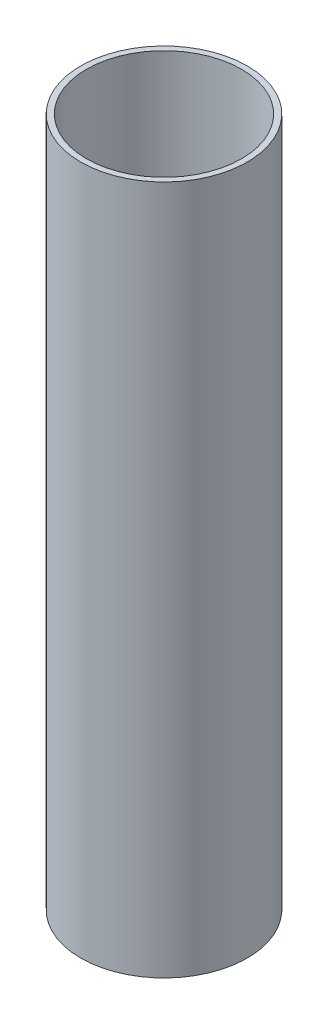
ISO-10303-21;
HEADER;
FILE_DESCRIPTION(('STEP AP214'),'2;1');
FILE_NAME('part.step','',(''),(''),'','','');
FILE_SCHEMA(('AUTOMOTIVE_DESIGN { 1 0 10303 214 1 1 1 1 }'));
ENDSEC;
DATA;
#1=APPLICATION_CONTEXT('core data for automotive mechanical design processes');
#2=APPLICATION_PROTOCOL_DEFINITION('international standard','automotive_design',2000,#1);
#3=PRODUCT_CONTEXT('',#1,'mechanical');
#4=PRODUCT('Part','Part','',(#3));
#5=PRODUCT_RELATED_PRODUCT_CATEGORY('part','',(#4));
#6=PRODUCT_DEFINITION_FORMATION('','',#4);
#7=PRODUCT_DEFINITION_CONTEXT('part definition',#1,'design');
#8=PRODUCT_DEFINITION('design','',#6,#7);
#9=PRODUCT_DEFINITION_SHAPE('','',#8);
#10=(LENGTH_UNIT() NAMED_UNIT(*) SI_UNIT(.MILLI.,.METRE.));
#11=(NAMED_UNIT(*) PLANE_ANGLE_UNIT() SI_UNIT($,.RADIAN.));
#12=(NAMED_UNIT(*) SI_UNIT($,.STERADIAN.) SOLID_ANGLE_UNIT());
#13=UNCERTAINTY_MEASURE_WITH_UNIT(LENGTH_MEASURE(1.E-05),#10,'distance_accuracy_value','');
#14=(GEOMETRIC_REPRESENTATION_CONTEXT(3) GLOBAL_UNCERTAINTY_ASSIGNED_CONTEXT((#13)) GLOBAL_UNIT_ASSIGNED_CONTEXT((#10,
#11,#12)) REPRESENTATION_CONTEXT('',''));
#15=CARTESIAN_POINT('',(0.,0.,0.));
#16=DIRECTION('',(0.,0.,1.));
#17=DIRECTION('',(1.,0.,0.));
#18=AXIS2_PLACEMENT_3D('',#15,#16,#17);
#19=CARTESIAN_POINT('',(0.,240.,0.));
#20=DIRECTION('',(0.,1.,0.));
#21=DIRECTION('',(0.,0.,1.));
#22=AXIS2_PLACEMENT_3D('',#19,#20,#21);
#23=PLANE('',#22);
#24=CARTESIAN_POINT('',(0.,240.,0.));
#25=DIRECTION('',(0.,1.,0.));
#26=DIRECTION('',(0.,0.,1.));
#27=AXIS2_PLACEMENT_3D('',#24,#25,#26);
#28=CIRCLE('',#27,29.);
#29=CARTESIAN_POINT('',(0.,240.,29.));
#30=VERTEX_POINT('',#29);
#31=EDGE_CURVE('E10',#30,#30,#28,.T.);
#32=ORIENTED_EDGE('',*,*,#31,.T.);
#33=EDGE_LOOP('',(#32));
#34=FACE_BOUND('',#33,.T.);
#35=CARTESIAN_POINT('',(0.,240.,0.));
#36=DIRECTION('',(0.,1.,0.));
#37=DIRECTION('',(0.,0.,1.));
#38=AXIS2_PLACEMENT_3D('',#35,#36,#37);
#39=CIRCLE('',#38,27.);
#40=CARTESIAN_POINT('',(0.,240.,27.));
#41=VERTEX_POINT('',#40);
#42=EDGE_CURVE('E41',#41,#41,#39,.T.);
#43=ORIENTED_EDGE('',*,*,#42,.F.);
#44=EDGE_LOOP('',(#43));
#45=FACE_BOUND('',#44,.T.);
#46=ADVANCED_FACE('F30',(#34,#45),#23,.T.);
#47=CARTESIAN_POINT('',(0.,0.,0.));
#48=DIRECTION('',(0.,1.,0.));
#49=DIRECTION('',(0.,0.,1.));
#50=AXIS2_PLACEMENT_3D('',#47,#48,#49);
#51=PLANE('',#50);
#52=CARTESIAN_POINT('',(0.,0.,0.));
#53=DIRECTION('',(0.,1.,0.));
#54=DIRECTION('',(0.,0.,1.));
#55=AXIS2_PLACEMENT_3D('',#52,#53,#54);
#56=CIRCLE('',#55,29.);
#57=CARTESIAN_POINT('',(0.,0.,29.));
#58=VERTEX_POINT('',#57);
#59=EDGE_CURVE('E34',#58,#58,#56,.T.);
#60=ORIENTED_EDGE('',*,*,#59,.F.);
#61=EDGE_LOOP('',(#60));
#62=FACE_BOUND('',#61,.T.);
#63=CARTESIAN_POINT('',(0.,0.,0.));
#64=DIRECTION('',(0.,1.,0.));
#65=DIRECTION('',(0.,0.,1.));
#66=AXIS2_PLACEMENT_3D('',#63,#64,#65);
#67=CIRCLE('',#66,27.);
#68=CARTESIAN_POINT('',(0.,0.,27.));
#69=VERTEX_POINT('',#68);
#70=EDGE_CURVE('E43',#69,#69,#67,.T.);
#71=ORIENTED_EDGE('',*,*,#70,.T.);
#72=EDGE_LOOP('',(#71));
#73=FACE_BOUND('',#72,.T.);
#74=ADVANCED_FACE('F53',(#62,#73),#51,.F.);
#75=CARTESIAN_POINT('',(0.,240.,0.));
#76=DIRECTION('',(0.,-1.,0.));
#77=DIRECTION('',(0.,0.,-1.));
#78=AXIS2_PLACEMENT_3D('',#75,#76,#77);
#79=CYLINDRICAL_SURFACE('',#78,29.);
#80=ORIENTED_EDGE('',*,*,#31,.F.);
#81=EDGE_LOOP('',(#80));
#82=FACE_BOUND('',#81,.T.);
#83=ORIENTED_EDGE('',*,*,#59,.T.);
#84=EDGE_LOOP('',(#83));
#85=FACE_BOUND('',#84,.T.);
#86=ADVANCED_FACE('F32',(#82,#85),#79,.T.);
#87=CARTESIAN_POINT('',(0.,240.,0.));
#88=DIRECTION('',(0.,-1.,0.));
#89=DIRECTION('',(0.,0.,-1.));
#90=AXIS2_PLACEMENT_3D('',#87,#88,#89);
#91=CYLINDRICAL_SURFACE('',#90,27.);
#92=ORIENTED_EDGE('',*,*,#42,.T.);
#93=EDGE_LOOP('',(#92));
#94=FACE_BOUND('',#93,.T.);
#95=ORIENTED_EDGE('',*,*,#70,.F.);
#96=EDGE_LOOP('',(#95));
#97=FACE_BOUND('',#96,.T.);
#98=ADVANCED_FACE('F49',(#94,#97),#91,.F.);
#99=CLOSED_SHELL('',(#46,#74,#86,#98));
#100=MANIFOLD_SOLID_BREP('B2',#99);
#101=ADVANCED_BREP_SHAPE_REPRESENTATION('',(#18,#100),#14);
#102=SHAPE_DEFINITION_REPRESENTATION(#9,#101);
ENDSEC;
END-ISO-10303-21;
